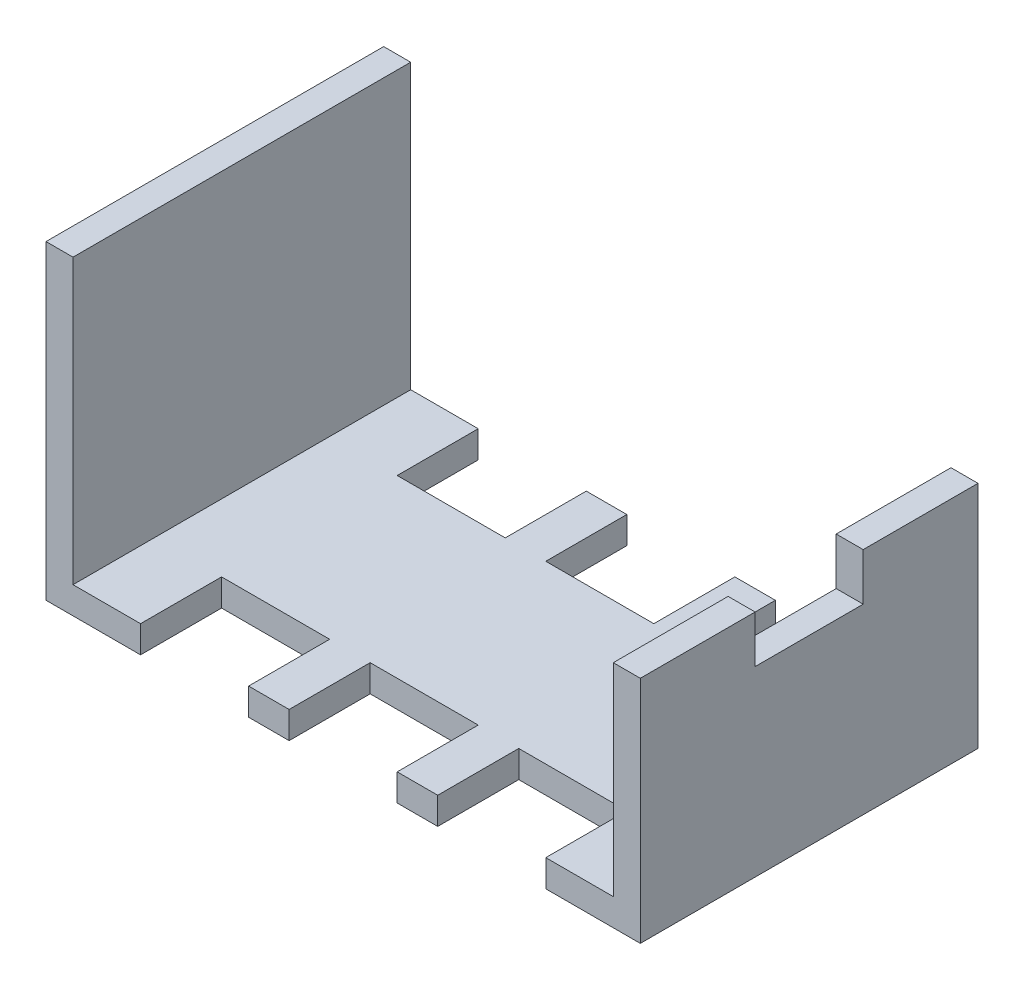
ISO-10303-21;
HEADER;
FILE_DESCRIPTION(('STEP AP214'),'2;1');
FILE_NAME('part.step','',(''),(''),'','','');
FILE_SCHEMA(('AUTOMOTIVE_DESIGN { 1 0 10303 214 1 1 1 1 }'));
ENDSEC;
DATA;
#1=APPLICATION_CONTEXT('core data for automotive mechanical design processes');
#2=APPLICATION_PROTOCOL_DEFINITION('international standard','automotive_design',2000,#1);
#3=PRODUCT_CONTEXT('',#1,'mechanical');
#4=PRODUCT('Part','Part','',(#3));
#5=PRODUCT_RELATED_PRODUCT_CATEGORY('part','',(#4));
#6=PRODUCT_DEFINITION_FORMATION('','',#4);
#7=PRODUCT_DEFINITION_CONTEXT('part definition',#1,'design');
#8=PRODUCT_DEFINITION('design','',#6,#7);
#9=PRODUCT_DEFINITION_SHAPE('','',#8);
#10=(LENGTH_UNIT() NAMED_UNIT(*) SI_UNIT(.MILLI.,.METRE.));
#11=(NAMED_UNIT(*) PLANE_ANGLE_UNIT() SI_UNIT($,.RADIAN.));
#12=(NAMED_UNIT(*) SI_UNIT($,.STERADIAN.) SOLID_ANGLE_UNIT());
#13=UNCERTAINTY_MEASURE_WITH_UNIT(LENGTH_MEASURE(1.E-05),#10,'distance_accuracy_value','');
#14=(GEOMETRIC_REPRESENTATION_CONTEXT(3) GLOBAL_UNCERTAINTY_ASSIGNED_CONTEXT((#13)) GLOBAL_UNIT_ASSIGNED_CONTEXT((#10,
#11,#12)) REPRESENTATION_CONTEXT('',''));
#15=CARTESIAN_POINT('',(0.,0.,0.));
#16=DIRECTION('',(0.,0.,1.));
#17=DIRECTION('',(1.,0.,0.));
#18=AXIS2_PLACEMENT_3D('',#15,#16,#17);
#19=CARTESIAN_POINT('',(0.,0.,0.));
#20=DIRECTION('',(0.,1.,0.));
#21=DIRECTION('',(0.,0.,1.));
#22=AXIS2_PLACEMENT_3D('',#19,#20,#21);
#23=PLANE('',#22);
#24=DIRECTION('',(0.,0.,-1.));
#25=VECTOR('',#24,1.);
#26=CARTESIAN_POINT('',(22.,0.,-14.5));
#27=LINE('',#26,#25);
#28=CARTESIAN_POINT('',(22.,0.,12.5));
#29=VERTEX_POINT('',#28);
#30=CARTESIAN_POINT('',(22.,0.,-12.5));
#31=VERTEX_POINT('',#30);
#32=EDGE_CURVE('E285',#29,#31,#27,.T.);
#33=ORIENTED_EDGE('',*,*,#32,.F.);
#34=DIRECTION('',(-1.,0.,0.));
#35=VECTOR('',#34,1.);
#36=CARTESIAN_POINT('',(-22.,0.,12.5));
#37=LINE('',#36,#35);
#38=CARTESIAN_POINT('',(15.,0.,12.5));
#39=VERTEX_POINT('',#38);
#40=EDGE_CURVE('E267',#29,#39,#37,.T.);
#41=ORIENTED_EDGE('',*,*,#40,.T.);
#42=DIRECTION('',(0.,0.,-1.));
#43=VECTOR('',#42,1.);
#44=CARTESIAN_POINT('',(15.,0.,12.5));
#45=LINE('',#44,#43);
#46=CARTESIAN_POINT('',(15.,0.,6.5));
#47=VERTEX_POINT('',#46);
#48=EDGE_CURVE('E470',#39,#47,#45,.T.);
#49=ORIENTED_EDGE('',*,*,#48,.T.);
#50=DIRECTION('',(1.,0.,0.));
#51=VECTOR('',#50,1.);
#52=CARTESIAN_POINT('',(7.00000000000001,0.,6.5));
#53=LINE('',#52,#51);
#54=CARTESIAN_POINT('',(7.00000000000001,0.,6.5));
#55=VERTEX_POINT('',#54);
#56=EDGE_CURVE('E467',#55,#47,#53,.T.);
#57=ORIENTED_EDGE('',*,*,#56,.F.);
#58=DIRECTION('',(0.,0.,-1.));
#59=VECTOR('',#58,1.);
#60=CARTESIAN_POINT('',(7.00000000000001,0.,12.5));
#61=LINE('',#60,#59);
#62=CARTESIAN_POINT('',(7.00000000000001,0.,12.5));
#63=VERTEX_POINT('',#62);
#64=EDGE_CURVE('E472',#63,#55,#61,.T.);
#65=ORIENTED_EDGE('',*,*,#64,.F.);
#66=CARTESIAN_POINT('',(4.00000000000001,0.,12.5));
#67=VERTEX_POINT('',#66);
#68=EDGE_CURVE('E278',#63,#67,#37,.T.);
#69=ORIENTED_EDGE('',*,*,#68,.T.);
#70=DIRECTION('',(0.,0.,-1.));
#71=VECTOR('',#70,1.);
#72=CARTESIAN_POINT('',(4.00000000000001,0.,12.5));
#73=LINE('',#72,#71);
#74=CARTESIAN_POINT('',(4.00000000000001,0.,6.5));
#75=VERTEX_POINT('',#74);
#76=EDGE_CURVE('E490',#67,#75,#73,.T.);
#77=ORIENTED_EDGE('',*,*,#76,.T.);
#78=DIRECTION('',(1.,0.,0.));
#79=VECTOR('',#78,1.);
#80=CARTESIAN_POINT('',(-3.99999999999999,0.,6.5));
#81=LINE('',#80,#79);
#82=CARTESIAN_POINT('',(-3.99999999999999,0.,6.5));
#83=VERTEX_POINT('',#82);
#84=EDGE_CURVE('E494',#83,#75,#81,.T.);
#85=ORIENTED_EDGE('',*,*,#84,.F.);
#86=DIRECTION('',(0.,0.,-1.));
#87=VECTOR('',#86,1.);
#88=CARTESIAN_POINT('',(-3.99999999999999,0.,12.5));
#89=LINE('',#88,#87);
#90=CARTESIAN_POINT('',(-3.99999999999999,0.,12.5));
#91=VERTEX_POINT('',#90);
#92=EDGE_CURVE('E497',#91,#83,#89,.T.);
#93=ORIENTED_EDGE('',*,*,#92,.F.);
#94=CARTESIAN_POINT('',(-6.99999999999999,0.,12.5));
#95=VERTEX_POINT('',#94);
#96=EDGE_CURVE('E533',#91,#95,#37,.T.);
#97=ORIENTED_EDGE('',*,*,#96,.T.);
#98=DIRECTION('',(0.,0.,-1.));
#99=VECTOR('',#98,1.);
#100=CARTESIAN_POINT('',(-6.99999999999999,0.,12.5));
#101=LINE('',#100,#99);
#102=CARTESIAN_POINT('',(-6.99999999999999,0.,6.5));
#103=VERTEX_POINT('',#102);
#104=EDGE_CURVE('E373',#95,#103,#101,.T.);
#105=ORIENTED_EDGE('',*,*,#104,.T.);
#106=DIRECTION('',(1.,0.,0.));
#107=VECTOR('',#106,1.);
#108=CARTESIAN_POINT('',(-15.,0.,6.5));
#109=LINE('',#108,#107);
#110=CARTESIAN_POINT('',(-15.,0.,6.5));
#111=VERTEX_POINT('',#110);
#112=EDGE_CURVE('E387',#111,#103,#109,.T.);
#113=ORIENTED_EDGE('',*,*,#112,.F.);
#114=DIRECTION('',(0.,0.,-1.));
#115=VECTOR('',#114,1.);
#116=CARTESIAN_POINT('',(-15.,0.,12.5));
#117=LINE('',#116,#115);
#118=CARTESIAN_POINT('',(-15.,0.,12.5));
#119=VERTEX_POINT('',#118);
#120=EDGE_CURVE('E377',#119,#111,#117,.T.);
#121=ORIENTED_EDGE('',*,*,#120,.F.);
#122=CARTESIAN_POINT('',(-22.,0.,12.5));
#123=VERTEX_POINT('',#122);
#124=EDGE_CURVE('E280',#119,#123,#37,.T.);
#125=ORIENTED_EDGE('',*,*,#124,.T.);
#126=DIRECTION('',(0.,0.,1.));
#127=VECTOR('',#126,1.);
#128=CARTESIAN_POINT('',(-22.,0.,-14.5));
#129=LINE('',#128,#127);
#130=CARTESIAN_POINT('',(-22.,0.,-12.5));
#131=VERTEX_POINT('',#130);
#132=EDGE_CURVE('E36',#131,#123,#129,.T.);
#133=ORIENTED_EDGE('',*,*,#132,.F.);
#134=DIRECTION('',(1.,0.,0.));
#135=VECTOR('',#134,1.);
#136=CARTESIAN_POINT('',(-22.,0.,-12.5));
#137=LINE('',#136,#135);
#138=CARTESIAN_POINT('',(-15.,0.,-12.5));
#139=VERTEX_POINT('',#138);
#140=EDGE_CURVE('E520',#131,#139,#137,.T.);
#141=ORIENTED_EDGE('',*,*,#140,.T.);
#142=DIRECTION('',(0.,0.,1.));
#143=VECTOR('',#142,1.);
#144=CARTESIAN_POINT('',(-15.,0.,-12.5));
#145=LINE('',#144,#143);
#146=CARTESIAN_POINT('',(-15.,0.,-6.5));
#147=VERTEX_POINT('',#146);
#148=EDGE_CURVE('E390',#139,#147,#145,.T.);
#149=ORIENTED_EDGE('',*,*,#148,.T.);
#150=DIRECTION('',(1.,0.,0.));
#151=VECTOR('',#150,1.);
#152=CARTESIAN_POINT('',(-15.,0.,-6.5));
#153=LINE('',#152,#151);
#154=CARTESIAN_POINT('',(-6.99999999999999,0.,-6.5));
#155=VERTEX_POINT('',#154);
#156=EDGE_CURVE('E394',#147,#155,#153,.T.);
#157=ORIENTED_EDGE('',*,*,#156,.T.);
#158=DIRECTION('',(0.,0.,1.));
#159=VECTOR('',#158,1.);
#160=CARTESIAN_POINT('',(-6.99999999999999,0.,-12.5));
#161=LINE('',#160,#159);
#162=CARTESIAN_POINT('',(-6.99999999999999,0.,-12.5));
#163=VERTEX_POINT('',#162);
#164=EDGE_CURVE('E397',#163,#155,#161,.T.);
#165=ORIENTED_EDGE('',*,*,#164,.F.);
#166=CARTESIAN_POINT('',(-3.99999999999999,0.,-12.5));
#167=VERTEX_POINT('',#166);
#168=EDGE_CURVE('E526',#163,#167,#137,.T.);
#169=ORIENTED_EDGE('',*,*,#168,.T.);
#170=DIRECTION('',(0.,0.,1.));
#171=VECTOR('',#170,1.);
#172=CARTESIAN_POINT('',(-3.99999999999999,0.,-12.5));
#173=LINE('',#172,#171);
#174=CARTESIAN_POINT('',(-3.99999999999999,0.,-6.5));
#175=VERTEX_POINT('',#174);
#176=EDGE_CURVE('E416',#167,#175,#173,.T.);
#177=ORIENTED_EDGE('',*,*,#176,.T.);
#178=DIRECTION('',(1.,0.,0.));
#179=VECTOR('',#178,1.);
#180=CARTESIAN_POINT('',(-3.99999999999999,0.,-6.5));
#181=LINE('',#180,#179);
#182=CARTESIAN_POINT('',(4.00000000000001,0.,-6.5));
#183=VERTEX_POINT('',#182);
#184=EDGE_CURVE('E420',#175,#183,#181,.T.);
#185=ORIENTED_EDGE('',*,*,#184,.T.);
#186=DIRECTION('',(0.,0.,1.));
#187=VECTOR('',#186,1.);
#188=CARTESIAN_POINT('',(4.00000000000001,0.,-12.5));
#189=LINE('',#188,#187);
#190=CARTESIAN_POINT('',(4.00000000000001,0.,-12.5));
#191=VERTEX_POINT('',#190);
#192=EDGE_CURVE('E423',#191,#183,#189,.T.);
#193=ORIENTED_EDGE('',*,*,#192,.F.);
#194=CARTESIAN_POINT('',(7.00000000000001,0.,-12.5));
#195=VERTEX_POINT('',#194);
#196=EDGE_CURVE('E604',#191,#195,#137,.T.);
#197=ORIENTED_EDGE('',*,*,#196,.T.);
#198=DIRECTION('',(0.,0.,1.));
#199=VECTOR('',#198,1.);
#200=CARTESIAN_POINT('',(7.00000000000001,0.,-12.5));
#201=LINE('',#200,#199);
#202=CARTESIAN_POINT('',(7.00000000000001,0.,-6.5));
#203=VERTEX_POINT('',#202);
#204=EDGE_CURVE('E440',#195,#203,#201,.T.);
#205=ORIENTED_EDGE('',*,*,#204,.T.);
#206=DIRECTION('',(1.,0.,0.));
#207=VECTOR('',#206,1.);
#208=CARTESIAN_POINT('',(7.00000000000001,0.,-6.5));
#209=LINE('',#208,#207);
#210=CARTESIAN_POINT('',(15.,0.,-6.5));
#211=VERTEX_POINT('',#210);
#212=EDGE_CURVE('E444',#203,#211,#209,.T.);
#213=ORIENTED_EDGE('',*,*,#212,.T.);
#214=DIRECTION('',(0.,0.,1.));
#215=VECTOR('',#214,1.);
#216=CARTESIAN_POINT('',(15.,0.,-12.5));
#217=LINE('',#216,#215);
#218=CARTESIAN_POINT('',(15.,0.,-12.5));
#219=VERTEX_POINT('',#218);
#220=EDGE_CURVE('E447',#219,#211,#217,.T.);
#221=ORIENTED_EDGE('',*,*,#220,.F.);
#222=EDGE_CURVE('E293',#219,#31,#137,.T.);
#223=ORIENTED_EDGE('',*,*,#222,.T.);
#224=EDGE_LOOP('',(#33,#41,#49,#57,#65,#69,#77,#85,#93,#97,#105,#113,#121,#125,#133,#141,#149,
#157,#165,#169,#177,#185,#193,#197,#205,#213,#221,#223));
#225=FACE_BOUND('',#224,.T.);
#226=ADVANCED_FACE('F32',(#225),#23,.F.);
#227=CARTESIAN_POINT('',(0.,2.,0.));
#228=DIRECTION('',(0.,-1.,0.));
#229=DIRECTION('',(0.,0.,-1.));
#230=AXIS2_PLACEMENT_3D('',#227,#228,#229);
#231=PLANE('',#230);
#232=DIRECTION('',(0.,0.,-1.));
#233=VECTOR('',#232,1.);
#234=CARTESIAN_POINT('',(-6.99999999999999,2.,12.5));
#235=LINE('',#234,#233);
#236=CARTESIAN_POINT('',(-6.99999999999999,2.,12.5));
#237=VERTEX_POINT('',#236);
#238=CARTESIAN_POINT('',(-6.99999999999999,2.,6.5));
#239=VERTEX_POINT('',#238);
#240=EDGE_CURVE('E374',#237,#239,#235,.T.);
#241=ORIENTED_EDGE('',*,*,#240,.F.);
#242=DIRECTION('',(1.,0.,0.));
#243=VECTOR('',#242,1.);
#244=CARTESIAN_POINT('',(0.,2.,12.5));
#245=LINE('',#244,#243);
#246=CARTESIAN_POINT('',(-3.99999999999999,2.,12.5));
#247=VERTEX_POINT('',#246);
#248=EDGE_CURVE('E411',#237,#247,#245,.T.);
#249=ORIENTED_EDGE('',*,*,#248,.T.);
#250=DIRECTION('',(0.,0.,-1.));
#251=VECTOR('',#250,1.);
#252=CARTESIAN_POINT('',(-3.99999999999999,2.,12.5));
#253=LINE('',#252,#251);
#254=CARTESIAN_POINT('',(-3.99999999999999,2.,6.5));
#255=VERTEX_POINT('',#254);
#256=EDGE_CURVE('E493',#247,#255,#253,.T.);
#257=ORIENTED_EDGE('',*,*,#256,.T.);
#258=DIRECTION('',(1.,0.,0.));
#259=VECTOR('',#258,1.);
#260=CARTESIAN_POINT('',(-3.99999999999999,2.,6.5));
#261=LINE('',#260,#259);
#262=CARTESIAN_POINT('',(4.00000000000001,2.,6.5));
#263=VERTEX_POINT('',#262);
#264=EDGE_CURVE('E502',#255,#263,#261,.T.);
#265=ORIENTED_EDGE('',*,*,#264,.T.);
#266=DIRECTION('',(0.,0.,-1.));
#267=VECTOR('',#266,1.);
#268=CARTESIAN_POINT('',(4.00000000000001,2.,12.5));
#269=LINE('',#268,#267);
#270=CARTESIAN_POINT('',(4.00000000000001,2.,12.5));
#271=VERTEX_POINT('',#270);
#272=EDGE_CURVE('E384',#271,#263,#269,.T.);
#273=ORIENTED_EDGE('',*,*,#272,.F.);
#274=CARTESIAN_POINT('',(7.00000000000001,2.,12.5));
#275=VERTEX_POINT('',#274);
#276=EDGE_CURVE('E516',#271,#275,#245,.T.);
#277=ORIENTED_EDGE('',*,*,#276,.T.);
#278=DIRECTION('',(0.,0.,-1.));
#279=VECTOR('',#278,1.);
#280=CARTESIAN_POINT('',(7.00000000000001,2.,12.5));
#281=LINE('',#280,#279);
#282=CARTESIAN_POINT('',(7.00000000000001,2.,6.5));
#283=VERTEX_POINT('',#282);
#284=EDGE_CURVE('E469',#275,#283,#281,.T.);
#285=ORIENTED_EDGE('',*,*,#284,.T.);
#286=DIRECTION('',(1.,0.,0.));
#287=VECTOR('',#286,1.);
#288=CARTESIAN_POINT('',(7.00000000000001,2.,6.5));
#289=LINE('',#288,#287);
#290=CARTESIAN_POINT('',(15.,2.,6.5));
#291=VERTEX_POINT('',#290);
#292=EDGE_CURVE('E475',#283,#291,#289,.T.);
#293=ORIENTED_EDGE('',*,*,#292,.T.);
#294=DIRECTION('',(0.,0.,-1.));
#295=VECTOR('',#294,1.);
#296=CARTESIAN_POINT('',(15.,2.,12.5));
#297=LINE('',#296,#295);
#298=CARTESIAN_POINT('',(15.,2.,12.5));
#299=VERTEX_POINT('',#298);
#300=EDGE_CURVE('E479',#299,#291,#297,.T.);
#301=ORIENTED_EDGE('',*,*,#300,.F.);
#302=DIRECTION('',(1.,0.,0.));
#303=VECTOR('',#302,1.);
#304=CARTESIAN_POINT('',(-20.,2.,12.5));
#305=LINE('',#304,#303);
#306=CARTESIAN_POINT('',(20.,2.,12.5));
#307=VERTEX_POINT('',#306);
#308=EDGE_CURVE('E310',#299,#307,#305,.T.);
#309=ORIENTED_EDGE('',*,*,#308,.T.);
#310=DIRECTION('',(0.,0.,1.));
#311=VECTOR('',#310,1.);
#312=CARTESIAN_POINT('',(20.,2.,-12.5));
#313=LINE('',#312,#311);
#314=CARTESIAN_POINT('',(20.,2.,-12.5));
#315=VERTEX_POINT('',#314);
#316=EDGE_CURVE('E318',#315,#307,#313,.T.);
#317=ORIENTED_EDGE('',*,*,#316,.F.);
#318=DIRECTION('',(1.,0.,0.));
#319=VECTOR('',#318,1.);
#320=CARTESIAN_POINT('',(-20.,2.,-12.5));
#321=LINE('',#320,#319);
#322=CARTESIAN_POINT('',(15.,2.,-12.5));
#323=VERTEX_POINT('',#322);
#324=EDGE_CURVE('E317',#323,#315,#321,.T.);
#325=ORIENTED_EDGE('',*,*,#324,.F.);
#326=DIRECTION('',(0.,0.,1.));
#327=VECTOR('',#326,1.);
#328=CARTESIAN_POINT('',(15.,2.,-12.5));
#329=LINE('',#328,#327);
#330=CARTESIAN_POINT('',(15.,2.,-6.5));
#331=VERTEX_POINT('',#330);
#332=EDGE_CURVE('E443',#323,#331,#329,.T.);
#333=ORIENTED_EDGE('',*,*,#332,.T.);
#334=DIRECTION('',(1.,0.,0.));
#335=VECTOR('',#334,1.);
#336=CARTESIAN_POINT('',(7.00000000000001,2.,-6.5));
#337=LINE('',#336,#335);
#338=CARTESIAN_POINT('',(7.00000000000001,2.,-6.5));
#339=VERTEX_POINT('',#338);
#340=EDGE_CURVE('E454',#339,#331,#337,.T.);
#341=ORIENTED_EDGE('',*,*,#340,.F.);
#342=DIRECTION('',(0.,0.,1.));
#343=VECTOR('',#342,1.);
#344=CARTESIAN_POINT('',(7.00000000000001,2.,-12.5));
#345=LINE('',#344,#343);
#346=CARTESIAN_POINT('',(7.00000000000001,2.,-12.5));
#347=VERTEX_POINT('',#346);
#348=EDGE_CURVE('E451',#347,#339,#345,.T.);
#349=ORIENTED_EDGE('',*,*,#348,.F.);
#350=CARTESIAN_POINT('',(4.00000000000001,2.,-12.5));
#351=VERTEX_POINT('',#350);
#352=EDGE_CURVE('E977',#351,#347,#321,.T.);
#353=ORIENTED_EDGE('',*,*,#352,.F.);
#354=DIRECTION('',(0.,0.,1.));
#355=VECTOR('',#354,1.);
#356=CARTESIAN_POINT('',(4.00000000000001,2.,-12.5));
#357=LINE('',#356,#355);
#358=CARTESIAN_POINT('',(4.00000000000001,2.,-6.5));
#359=VERTEX_POINT('',#358);
#360=EDGE_CURVE('E419',#351,#359,#357,.T.);
#361=ORIENTED_EDGE('',*,*,#360,.T.);
#362=DIRECTION('',(1.,0.,0.));
#363=VECTOR('',#362,1.);
#364=CARTESIAN_POINT('',(-3.99999999999999,2.,-6.5));
#365=LINE('',#364,#363);
#366=CARTESIAN_POINT('',(-3.99999999999999,2.,-6.5));
#367=VERTEX_POINT('',#366);
#368=EDGE_CURVE('E429',#367,#359,#365,.T.);
#369=ORIENTED_EDGE('',*,*,#368,.F.);
#370=DIRECTION('',(0.,0.,1.));
#371=VECTOR('',#370,1.);
#372=CARTESIAN_POINT('',(-3.99999999999999,2.,-12.5));
#373=LINE('',#372,#371);
#374=CARTESIAN_POINT('',(-3.99999999999999,2.,-12.5));
#375=VERTEX_POINT('',#374);
#376=EDGE_CURVE('E426',#375,#367,#373,.T.);
#377=ORIENTED_EDGE('',*,*,#376,.F.);
#378=CARTESIAN_POINT('',(-6.99999999999999,2.,-12.5));
#379=VERTEX_POINT('',#378);
#380=EDGE_CURVE('E316',#379,#375,#321,.T.);
#381=ORIENTED_EDGE('',*,*,#380,.F.);
#382=DIRECTION('',(0.,0.,1.));
#383=VECTOR('',#382,1.);
#384=CARTESIAN_POINT('',(-6.99999999999999,2.,-12.5));
#385=LINE('',#384,#383);
#386=CARTESIAN_POINT('',(-6.99999999999999,2.,-6.5));
#387=VERTEX_POINT('',#386);
#388=EDGE_CURVE('E393',#379,#387,#385,.T.);
#389=ORIENTED_EDGE('',*,*,#388,.T.);
#390=DIRECTION('',(1.,0.,0.));
#391=VECTOR('',#390,1.);
#392=CARTESIAN_POINT('',(-15.,2.,-6.5));
#393=LINE('',#392,#391);
#394=CARTESIAN_POINT('',(-15.,2.,-6.5));
#395=VERTEX_POINT('',#394);
#396=EDGE_CURVE('E403',#395,#387,#393,.T.);
#397=ORIENTED_EDGE('',*,*,#396,.F.);
#398=DIRECTION('',(0.,0.,1.));
#399=VECTOR('',#398,1.);
#400=CARTESIAN_POINT('',(-15.,2.,-12.5));
#401=LINE('',#400,#399);
#402=CARTESIAN_POINT('',(-15.,2.,-12.5));
#403=VERTEX_POINT('',#402);
#404=EDGE_CURVE('E400',#403,#395,#401,.T.);
#405=ORIENTED_EDGE('',*,*,#404,.F.);
#406=CARTESIAN_POINT('',(-20.,2.,-12.5));
#407=VERTEX_POINT('',#406);
#408=EDGE_CURVE('E314',#407,#403,#321,.T.);
#409=ORIENTED_EDGE('',*,*,#408,.F.);
#410=DIRECTION('',(0.,0.,1.));
#411=VECTOR('',#410,1.);
#412=CARTESIAN_POINT('',(-20.,2.,-12.5));
#413=LINE('',#412,#411);
#414=CARTESIAN_POINT('',(-20.,2.,12.5));
#415=VERTEX_POINT('',#414);
#416=EDGE_CURVE('E303',#407,#415,#413,.T.);
#417=ORIENTED_EDGE('',*,*,#416,.T.);
#418=CARTESIAN_POINT('',(-15.,2.,12.5));
#419=VERTEX_POINT('',#418);
#420=EDGE_CURVE('E321',#415,#419,#305,.T.);
#421=ORIENTED_EDGE('',*,*,#420,.T.);
#422=DIRECTION('',(0.,0.,-1.));
#423=VECTOR('',#422,1.);
#424=CARTESIAN_POINT('',(-15.,2.,12.5));
#425=LINE('',#424,#423);
#426=CARTESIAN_POINT('',(-15.,2.,6.5));
#427=VERTEX_POINT('',#426);
#428=EDGE_CURVE('E381',#419,#427,#425,.T.);
#429=ORIENTED_EDGE('',*,*,#428,.T.);
#430=DIRECTION('',(1.,0.,0.));
#431=VECTOR('',#430,1.);
#432=CARTESIAN_POINT('',(-15.,2.,6.5));
#433=LINE('',#432,#431);
#434=EDGE_CURVE('E378',#427,#239,#433,.T.);
#435=ORIENTED_EDGE('',*,*,#434,.T.);
#436=EDGE_LOOP('',(#241,#249,#257,#265,#273,#277,#285,#293,#301,#309,#317,#325,#333,#341,#349,
#353,#361,#369,#377,#381,#389,#397,#405,#409,#417,#421,#429,#435));
#437=FACE_BOUND('',#436,.T.);
#438=ADVANCED_FACE('F561',(#437),#231,.F.);
#439=CARTESIAN_POINT('',(22.,23.,-14.5));
#440=DIRECTION('',(-1.,0.,0.));
#441=DIRECTION('',(0.,0.,1.));
#442=AXIS2_PLACEMENT_3D('',#439,#440,#441);
#443=PLANE('',#442);
#444=DIRECTION('',(0.,0.,-1.));
#445=VECTOR('',#444,1.);
#446=CARTESIAN_POINT('',(22.,17.,12.5));
#447=LINE('',#446,#445);
#448=CARTESIAN_POINT('',(22.,17.,12.5));
#449=VERTEX_POINT('',#448);
#450=CARTESIAN_POINT('',(22.,17.,4.));
#451=VERTEX_POINT('',#450);
#452=EDGE_CURVE('E288',#449,#451,#447,.T.);
#453=ORIENTED_EDGE('',*,*,#452,.F.);
#454=DIRECTION('',(0.,1.,0.));
#455=VECTOR('',#454,1.);
#456=CARTESIAN_POINT('',(22.,0.,12.5));
#457=LINE('',#456,#455);
#458=EDGE_CURVE('E270',#29,#449,#457,.T.);
#459=ORIENTED_EDGE('',*,*,#458,.F.);
#460=ORIENTED_EDGE('',*,*,#32,.T.);
#461=DIRECTION('',(0.,1.,0.));
#462=VECTOR('',#461,1.);
#463=CARTESIAN_POINT('',(22.,0.,-12.5));
#464=LINE('',#463,#462);
#465=CARTESIAN_POINT('',(22.,17.,-12.5));
#466=VERTEX_POINT('',#465);
#467=EDGE_CURVE('E519',#31,#466,#464,.T.);
#468=ORIENTED_EDGE('',*,*,#467,.T.);
#469=DIRECTION('',(0.,0.,-1.));
#470=VECTOR('',#469,1.);
#471=CARTESIAN_POINT('',(22.,17.,-4.));
#472=LINE('',#471,#470);
#473=CARTESIAN_POINT('',(22.,17.,-4.));
#474=VERTEX_POINT('',#473);
#475=EDGE_CURVE('E336',#474,#466,#472,.T.);
#476=ORIENTED_EDGE('',*,*,#475,.F.);
#477=DIRECTION('',(0.,1.,0.));
#478=VECTOR('',#477,1.);
#479=CARTESIAN_POINT('',(22.,13.5,-4.));
#480=LINE('',#479,#478);
#481=CARTESIAN_POINT('',(22.,13.5,-4.));
#482=VERTEX_POINT('',#481);
#483=EDGE_CURVE('E340',#482,#474,#480,.T.);
#484=ORIENTED_EDGE('',*,*,#483,.F.);
#485=DIRECTION('',(0.,0.,-1.));
#486=VECTOR('',#485,1.);
#487=CARTESIAN_POINT('',(22.,13.5,4.));
#488=LINE('',#487,#486);
#489=CARTESIAN_POINT('',(22.,13.5,4.));
#490=VERTEX_POINT('',#489);
#491=EDGE_CURVE('E343',#490,#482,#488,.T.);
#492=ORIENTED_EDGE('',*,*,#491,.F.);
#493=DIRECTION('',(0.,-1.,0.));
#494=VECTOR('',#493,1.);
#495=CARTESIAN_POINT('',(22.,13.5,4.));
#496=LINE('',#495,#494);
#497=EDGE_CURVE('E346',#451,#490,#496,.T.);
#498=ORIENTED_EDGE('',*,*,#497,.F.);
#499=EDGE_LOOP('',(#453,#459,#460,#468,#476,#484,#492,#498));
#500=FACE_BOUND('',#499,.T.);
#501=ADVANCED_FACE('F34',(#500),#443,.F.);
#502=CARTESIAN_POINT('',(-22.,23.,-14.5));
#503=DIRECTION('',(1.,0.,0.));
#504=DIRECTION('',(0.,0.,-1.));
#505=AXIS2_PLACEMENT_3D('',#502,#503,#504);
#506=PLANE('',#505);
#507=ORIENTED_EDGE('',*,*,#132,.T.);
#508=DIRECTION('',(0.,1.,0.));
#509=VECTOR('',#508,1.);
#510=CARTESIAN_POINT('',(-22.,0.,12.5));
#511=LINE('',#510,#509);
#512=CARTESIAN_POINT('',(-22.,23.,12.5));
#513=VERTEX_POINT('',#512);
#514=EDGE_CURVE('E289',#123,#513,#511,.T.);
#515=ORIENTED_EDGE('',*,*,#514,.T.);
#516=DIRECTION('',(0.,0.,1.));
#517=VECTOR('',#516,1.);
#518=CARTESIAN_POINT('',(-22.,23.,-14.5));
#519=LINE('',#518,#517);
#520=CARTESIAN_POINT('',(-22.,23.,-12.5));
#521=VERTEX_POINT('',#520);
#522=EDGE_CURVE('E11',#521,#513,#519,.T.);
#523=ORIENTED_EDGE('',*,*,#522,.F.);
#524=DIRECTION('',(0.,1.,0.));
#525=VECTOR('',#524,1.);
#526=CARTESIAN_POINT('',(-22.,0.,-12.5));
#527=LINE('',#526,#525);
#528=EDGE_CURVE('E517',#131,#521,#527,.T.);
#529=ORIENTED_EDGE('',*,*,#528,.F.);
#530=EDGE_LOOP('',(#507,#515,#523,#529));
#531=FACE_BOUND('',#530,.T.);
#532=ADVANCED_FACE('F586',(#531),#506,.F.);
#533=CARTESIAN_POINT('',(0.,23.,0.));
#534=DIRECTION('',(0.,1.,0.));
#535=DIRECTION('',(0.,0.,1.));
#536=AXIS2_PLACEMENT_3D('',#533,#534,#535);
#537=PLANE('',#536);
#538=DIRECTION('',(-1.,0.,0.));
#539=VECTOR('',#538,1.);
#540=CARTESIAN_POINT('',(-22.,23.,12.5));
#541=LINE('',#540,#539);
#542=CARTESIAN_POINT('',(-20.,23.,12.5));
#543=VERTEX_POINT('',#542);
#544=EDGE_CURVE('E522',#543,#513,#541,.T.);
#545=ORIENTED_EDGE('',*,*,#544,.F.);
#546=DIRECTION('',(0.,0.,1.));
#547=VECTOR('',#546,1.);
#548=CARTESIAN_POINT('',(-20.,23.,-12.5));
#549=LINE('',#548,#547);
#550=CARTESIAN_POINT('',(-20.,23.,-12.5));
#551=VERTEX_POINT('',#550);
#552=EDGE_CURVE('E307',#551,#543,#549,.T.);
#553=ORIENTED_EDGE('',*,*,#552,.F.);
#554=DIRECTION('',(1.,0.,0.));
#555=VECTOR('',#554,1.);
#556=CARTESIAN_POINT('',(-22.,23.,-12.5));
#557=LINE('',#556,#555);
#558=EDGE_CURVE('E523',#521,#551,#557,.T.);
#559=ORIENTED_EDGE('',*,*,#558,.F.);
#560=ORIENTED_EDGE('',*,*,#522,.T.);
#561=EDGE_LOOP('',(#545,#553,#559,#560));
#562=FACE_BOUND('',#561,.T.);
#563=ADVANCED_FACE('F582',(#562),#537,.T.);
#564=CARTESIAN_POINT('',(-20.,2.,-12.5));
#565=DIRECTION('',(-1.,0.,0.));
#566=DIRECTION('',(0.,0.,1.));
#567=AXIS2_PLACEMENT_3D('',#564,#565,#566);
#568=PLANE('',#567);
#569=ORIENTED_EDGE('',*,*,#552,.T.);
#570=DIRECTION('',(0.,1.,0.));
#571=VECTOR('',#570,1.);
#572=CARTESIAN_POINT('',(-20.,2.,12.5));
#573=LINE('',#572,#571);
#574=EDGE_CURVE('E294',#415,#543,#573,.T.);
#575=ORIENTED_EDGE('',*,*,#574,.F.);
#576=ORIENTED_EDGE('',*,*,#416,.F.);
#577=DIRECTION('',(0.,1.,0.));
#578=VECTOR('',#577,1.);
#579=CARTESIAN_POINT('',(-20.,2.,-12.5));
#580=LINE('',#579,#578);
#581=EDGE_CURVE('E296',#407,#551,#580,.T.);
#582=ORIENTED_EDGE('',*,*,#581,.T.);
#583=EDGE_LOOP('',(#569,#575,#576,#582));
#584=FACE_BOUND('',#583,.T.);
#585=ADVANCED_FACE('F578',(#584),#568,.F.);
#586=CARTESIAN_POINT('',(20.,2.,-12.5));
#587=DIRECTION('',(-1.,0.,0.));
#588=DIRECTION('',(0.,0.,1.));
#589=AXIS2_PLACEMENT_3D('',#586,#587,#588);
#590=PLANE('',#589);
#591=DIRECTION('',(0.,1.,0.));
#592=VECTOR('',#591,1.);
#593=CARTESIAN_POINT('',(20.,2.,-12.5));
#594=LINE('',#593,#592);
#595=CARTESIAN_POINT('',(20.,17.,-12.5));
#596=VERTEX_POINT('',#595);
#597=EDGE_CURVE('E302',#315,#596,#594,.T.);
#598=ORIENTED_EDGE('',*,*,#597,.F.);
#599=ORIENTED_EDGE('',*,*,#316,.T.);
#600=DIRECTION('',(0.,1.,0.));
#601=VECTOR('',#600,1.);
#602=CARTESIAN_POINT('',(20.,2.,12.5));
#603=LINE('',#602,#601);
#604=CARTESIAN_POINT('',(20.,17.,12.5));
#605=VERTEX_POINT('',#604);
#606=EDGE_CURVE('E299',#307,#605,#603,.T.);
#607=ORIENTED_EDGE('',*,*,#606,.T.);
#608=DIRECTION('',(0.,0.,-1.));
#609=VECTOR('',#608,1.);
#610=CARTESIAN_POINT('',(20.,17.,12.5));
#611=LINE('',#610,#609);
#612=CARTESIAN_POINT('',(20.,17.,4.));
#613=VERTEX_POINT('',#612);
#614=EDGE_CURVE('E339',#605,#613,#611,.T.);
#615=ORIENTED_EDGE('',*,*,#614,.T.);
#616=DIRECTION('',(0.,-1.,0.));
#617=VECTOR('',#616,1.);
#618=CARTESIAN_POINT('',(20.,13.5,4.));
#619=LINE('',#618,#617);
#620=CARTESIAN_POINT('',(20.,13.5,4.));
#621=VERTEX_POINT('',#620);
#622=EDGE_CURVE('E359',#613,#621,#619,.T.);
#623=ORIENTED_EDGE('',*,*,#622,.T.);
#624=DIRECTION('',(0.,0.,-1.));
#625=VECTOR('',#624,1.);
#626=CARTESIAN_POINT('',(20.,13.5,4.));
#627=LINE('',#626,#625);
#628=CARTESIAN_POINT('',(20.,13.5,-4.));
#629=VERTEX_POINT('',#628);
#630=EDGE_CURVE('E356',#621,#629,#627,.T.);
#631=ORIENTED_EDGE('',*,*,#630,.T.);
#632=DIRECTION('',(0.,1.,0.));
#633=VECTOR('',#632,1.);
#634=CARTESIAN_POINT('',(20.,13.5,-4.));
#635=LINE('',#634,#633);
#636=CARTESIAN_POINT('',(20.,17.,-4.));
#637=VERTEX_POINT('',#636);
#638=EDGE_CURVE('E353',#629,#637,#635,.T.);
#639=ORIENTED_EDGE('',*,*,#638,.T.);
#640=DIRECTION('',(0.,0.,-1.));
#641=VECTOR('',#640,1.);
#642=CARTESIAN_POINT('',(20.,17.,-4.));
#643=LINE('',#642,#641);
#644=EDGE_CURVE('E327',#637,#596,#643,.T.);
#645=ORIENTED_EDGE('',*,*,#644,.T.);
#646=EDGE_LOOP('',(#598,#599,#607,#615,#623,#631,#639,#645));
#647=FACE_BOUND('',#646,.T.);
#648=ADVANCED_FACE('F647',(#647),#590,.T.);
#649=CARTESIAN_POINT('',(20.,17.,-4.));
#650=DIRECTION('',(0.,-1.,0.));
#651=DIRECTION('',(0.,0.,-1.));
#652=AXIS2_PLACEMENT_3D('',#649,#650,#651);
#653=PLANE('',#652);
#654=ORIENTED_EDGE('',*,*,#475,.T.);
#655=DIRECTION('',(1.,0.,0.));
#656=VECTOR('',#655,1.);
#657=CARTESIAN_POINT('',(20.,17.,-12.5));
#658=LINE('',#657,#656);
#659=EDGE_CURVE('E311',#596,#466,#658,.T.);
#660=ORIENTED_EDGE('',*,*,#659,.F.);
#661=ORIENTED_EDGE('',*,*,#644,.F.);
#662=DIRECTION('',(1.,0.,0.));
#663=VECTOR('',#662,1.);
#664=CARTESIAN_POINT('',(20.,17.,-4.));
#665=LINE('',#664,#663);
#666=EDGE_CURVE('E333',#637,#474,#665,.T.);
#667=ORIENTED_EDGE('',*,*,#666,.T.);
#668=EDGE_LOOP('',(#654,#660,#661,#667));
#669=FACE_BOUND('',#668,.T.);
#670=ADVANCED_FACE('F629',(#669),#653,.F.);
#671=CARTESIAN_POINT('',(20.,13.5,-4.));
#672=DIRECTION('',(0.,0.,-1.));
#673=DIRECTION('',(-1.,0.,0.));
#674=AXIS2_PLACEMENT_3D('',#671,#672,#673);
#675=PLANE('',#674);
#676=ORIENTED_EDGE('',*,*,#483,.T.);
#677=ORIENTED_EDGE('',*,*,#666,.F.);
#678=ORIENTED_EDGE('',*,*,#638,.F.);
#679=DIRECTION('',(1.,0.,0.));
#680=VECTOR('',#679,1.);
#681=CARTESIAN_POINT('',(20.,13.5,-4.));
#682=LINE('',#681,#680);
#683=EDGE_CURVE('E331',#629,#482,#682,.T.);
#684=ORIENTED_EDGE('',*,*,#683,.T.);
#685=EDGE_LOOP('',(#676,#677,#678,#684));
#686=FACE_BOUND('',#685,.T.);
#687=ADVANCED_FACE('F633',(#686),#675,.F.);
#688=CARTESIAN_POINT('',(20.,13.5,4.));
#689=DIRECTION('',(0.,-1.,0.));
#690=DIRECTION('',(0.,0.,-1.));
#691=AXIS2_PLACEMENT_3D('',#688,#689,#690);
#692=PLANE('',#691);
#693=ORIENTED_EDGE('',*,*,#491,.T.);
#694=ORIENTED_EDGE('',*,*,#683,.F.);
#695=ORIENTED_EDGE('',*,*,#630,.F.);
#696=DIRECTION('',(1.,0.,0.));
#697=VECTOR('',#696,1.);
#698=CARTESIAN_POINT('',(20.,13.5,4.));
#699=LINE('',#698,#697);
#700=EDGE_CURVE('E329',#621,#490,#699,.T.);
#701=ORIENTED_EDGE('',*,*,#700,.T.);
#702=EDGE_LOOP('',(#693,#694,#695,#701));
#703=FACE_BOUND('',#702,.T.);
#704=ADVANCED_FACE('F636',(#703),#692,.F.);
#705=CARTESIAN_POINT('',(20.,13.5,4.));
#706=DIRECTION('',(0.,0.,1.));
#707=DIRECTION('',(1.,0.,0.));
#708=AXIS2_PLACEMENT_3D('',#705,#706,#707);
#709=PLANE('',#708);
#710=ORIENTED_EDGE('',*,*,#497,.T.);
#711=ORIENTED_EDGE('',*,*,#700,.F.);
#712=ORIENTED_EDGE('',*,*,#622,.F.);
#713=DIRECTION('',(1.,0.,0.));
#714=VECTOR('',#713,1.);
#715=CARTESIAN_POINT('',(20.,17.,4.));
#716=LINE('',#715,#714);
#717=EDGE_CURVE('E326',#613,#451,#716,.T.);
#718=ORIENTED_EDGE('',*,*,#717,.T.);
#719=EDGE_LOOP('',(#710,#711,#712,#718));
#720=FACE_BOUND('',#719,.T.);
#721=ADVANCED_FACE('F639',(#720),#709,.F.);
#722=CARTESIAN_POINT('',(20.,17.,12.5));
#723=DIRECTION('',(0.,-1.,0.));
#724=DIRECTION('',(0.,0.,-1.));
#725=AXIS2_PLACEMENT_3D('',#722,#723,#724);
#726=PLANE('',#725);
#727=ORIENTED_EDGE('',*,*,#452,.T.);
#728=ORIENTED_EDGE('',*,*,#717,.F.);
#729=ORIENTED_EDGE('',*,*,#614,.F.);
#730=DIRECTION('',(1.,0.,0.));
#731=VECTOR('',#730,1.);
#732=CARTESIAN_POINT('',(20.,17.,12.5));
#733=LINE('',#732,#731);
#734=EDGE_CURVE('E324',#605,#449,#733,.T.);
#735=ORIENTED_EDGE('',*,*,#734,.T.);
#736=EDGE_LOOP('',(#727,#728,#729,#735));
#737=FACE_BOUND('',#736,.T.);
#738=ADVANCED_FACE('F643',(#737),#726,.F.);
#739=CARTESIAN_POINT('',(-15.,0.,12.5));
#740=DIRECTION('',(1.,0.,0.));
#741=DIRECTION('',(0.,0.,-1.));
#742=AXIS2_PLACEMENT_3D('',#739,#740,#741);
#743=PLANE('',#742);
#744=ORIENTED_EDGE('',*,*,#428,.F.);
#745=DIRECTION('',(0.,1.,0.));
#746=VECTOR('',#745,1.);
#747=CARTESIAN_POINT('',(-15.,0.,12.5));
#748=LINE('',#747,#746);
#749=EDGE_CURVE('E371',#119,#419,#748,.T.);
#750=ORIENTED_EDGE('',*,*,#749,.F.);
#751=ORIENTED_EDGE('',*,*,#120,.T.);
#752=DIRECTION('',(0.,1.,0.));
#753=VECTOR('',#752,1.);
#754=CARTESIAN_POINT('',(-15.,0.,6.5));
#755=LINE('',#754,#753);
#756=EDGE_CURVE('E350',#111,#427,#755,.T.);
#757=ORIENTED_EDGE('',*,*,#756,.T.);
#758=EDGE_LOOP('',(#744,#750,#751,#757));
#759=FACE_BOUND('',#758,.T.);
#760=ADVANCED_FACE('F571',(#759),#743,.T.);
#761=CARTESIAN_POINT('',(-15.,0.,6.5));
#762=DIRECTION('',(0.,0.,1.));
#763=DIRECTION('',(1.,0.,0.));
#764=AXIS2_PLACEMENT_3D('',#761,#762,#763);
#765=PLANE('',#764);
#766=ORIENTED_EDGE('',*,*,#434,.F.);
#767=ORIENTED_EDGE('',*,*,#756,.F.);
#768=ORIENTED_EDGE('',*,*,#112,.T.);
#769=DIRECTION('',(0.,1.,0.));
#770=VECTOR('',#769,1.);
#771=CARTESIAN_POINT('',(-6.99999999999999,0.,6.5));
#772=LINE('',#771,#770);
#773=EDGE_CURVE('E366',#103,#239,#772,.T.);
#774=ORIENTED_EDGE('',*,*,#773,.T.);
#775=EDGE_LOOP('',(#766,#767,#768,#774));
#776=FACE_BOUND('',#775,.T.);
#777=ADVANCED_FACE('F568',(#776),#765,.T.);
#778=CARTESIAN_POINT('',(-6.99999999999999,0.,12.5));
#779=DIRECTION('',(1.,0.,0.));
#780=DIRECTION('',(0.,0.,-1.));
#781=AXIS2_PLACEMENT_3D('',#778,#779,#780);
#782=PLANE('',#781);
#783=ORIENTED_EDGE('',*,*,#240,.T.);
#784=ORIENTED_EDGE('',*,*,#773,.F.);
#785=ORIENTED_EDGE('',*,*,#104,.F.);
#786=DIRECTION('',(0.,1.,0.));
#787=VECTOR('',#786,1.);
#788=CARTESIAN_POINT('',(-6.99999999999999,0.,12.5));
#789=LINE('',#788,#787);
#790=EDGE_CURVE('E368',#95,#237,#789,.T.);
#791=ORIENTED_EDGE('',*,*,#790,.T.);
#792=EDGE_LOOP('',(#783,#784,#785,#791));
#793=FACE_BOUND('',#792,.T.);
#794=ADVANCED_FACE('F564',(#793),#782,.F.);
#795=CARTESIAN_POINT('',(-3.99999999999999,0.,12.5));
#796=DIRECTION('',(1.,0.,0.));
#797=DIRECTION('',(0.,0.,-1.));
#798=AXIS2_PLACEMENT_3D('',#795,#796,#797);
#799=PLANE('',#798);
#800=ORIENTED_EDGE('',*,*,#256,.F.);
#801=DIRECTION('',(0.,1.,0.));
#802=VECTOR('',#801,1.);
#803=CARTESIAN_POINT('',(-3.99999999999999,0.,12.5));
#804=LINE('',#803,#802);
#805=EDGE_CURVE('E478',#91,#247,#804,.T.);
#806=ORIENTED_EDGE('',*,*,#805,.F.);
#807=ORIENTED_EDGE('',*,*,#92,.T.);
#808=DIRECTION('',(0.,1.,0.));
#809=VECTOR('',#808,1.);
#810=CARTESIAN_POINT('',(-3.99999999999999,0.,6.5));
#811=LINE('',#810,#809);
#812=EDGE_CURVE('E508',#83,#255,#811,.T.);
#813=ORIENTED_EDGE('',*,*,#812,.T.);
#814=EDGE_LOOP('',(#800,#806,#807,#813));
#815=FACE_BOUND('',#814,.T.);
#816=ADVANCED_FACE('F556',(#815),#799,.T.);
#817=CARTESIAN_POINT('',(-3.99999999999999,0.,6.5));
#818=DIRECTION('',(0.,0.,1.));
#819=DIRECTION('',(1.,0.,0.));
#820=AXIS2_PLACEMENT_3D('',#817,#818,#819);
#821=PLANE('',#820);
#822=ORIENTED_EDGE('',*,*,#264,.F.);
#823=ORIENTED_EDGE('',*,*,#812,.F.);
#824=ORIENTED_EDGE('',*,*,#84,.T.);
#825=DIRECTION('',(0.,1.,0.));
#826=VECTOR('',#825,1.);
#827=CARTESIAN_POINT('',(4.00000000000001,0.,6.5));
#828=LINE('',#827,#826);
#829=EDGE_CURVE('E510',#75,#263,#828,.T.);
#830=ORIENTED_EDGE('',*,*,#829,.T.);
#831=EDGE_LOOP('',(#822,#823,#824,#830));
#832=FACE_BOUND('',#831,.T.);
#833=ADVANCED_FACE('F552',(#832),#821,.T.);
#834=CARTESIAN_POINT('',(4.00000000000001,0.,12.5));
#835=DIRECTION('',(1.,0.,0.));
#836=DIRECTION('',(0.,0.,-1.));
#837=AXIS2_PLACEMENT_3D('',#834,#835,#836);
#838=PLANE('',#837);
#839=ORIENTED_EDGE('',*,*,#272,.T.);
#840=ORIENTED_EDGE('',*,*,#829,.F.);
#841=ORIENTED_EDGE('',*,*,#76,.F.);
#842=DIRECTION('',(0.,1.,0.));
#843=VECTOR('',#842,1.);
#844=CARTESIAN_POINT('',(4.00000000000001,0.,12.5));
#845=LINE('',#844,#843);
#846=EDGE_CURVE('E499',#67,#271,#845,.T.);
#847=ORIENTED_EDGE('',*,*,#846,.T.);
#848=EDGE_LOOP('',(#839,#840,#841,#847));
#849=FACE_BOUND('',#848,.T.);
#850=ADVANCED_FACE('F547',(#849),#838,.F.);
#851=CARTESIAN_POINT('',(7.00000000000001,0.,6.5));
#852=DIRECTION('',(0.,0.,1.));
#853=DIRECTION('',(1.,0.,0.));
#854=AXIS2_PLACEMENT_3D('',#851,#852,#853);
#855=PLANE('',#854);
#856=ORIENTED_EDGE('',*,*,#292,.F.);
#857=DIRECTION('',(0.,1.,0.));
#858=VECTOR('',#857,1.);
#859=CARTESIAN_POINT('',(7.00000000000001,0.,6.5));
#860=LINE('',#859,#858);
#861=EDGE_CURVE('E474',#55,#283,#860,.T.);
#862=ORIENTED_EDGE('',*,*,#861,.F.);
#863=ORIENTED_EDGE('',*,*,#56,.T.);
#864=DIRECTION('',(0.,1.,0.));
#865=VECTOR('',#864,1.);
#866=CARTESIAN_POINT('',(15.,0.,6.5));
#867=LINE('',#866,#865);
#868=EDGE_CURVE('E453',#47,#291,#867,.T.);
#869=ORIENTED_EDGE('',*,*,#868,.T.);
#870=EDGE_LOOP('',(#856,#862,#863,#869));
#871=FACE_BOUND('',#870,.T.);
#872=ADVANCED_FACE('F654',(#871),#855,.T.);
#873=CARTESIAN_POINT('',(15.,0.,12.5));
#874=DIRECTION('',(1.,0.,0.));
#875=DIRECTION('',(0.,0.,-1.));
#876=AXIS2_PLACEMENT_3D('',#873,#874,#875);
#877=PLANE('',#876);
#878=ORIENTED_EDGE('',*,*,#300,.T.);
#879=ORIENTED_EDGE('',*,*,#868,.F.);
#880=ORIENTED_EDGE('',*,*,#48,.F.);
#881=DIRECTION('',(0.,1.,0.));
#882=VECTOR('',#881,1.);
#883=CARTESIAN_POINT('',(15.,0.,12.5));
#884=LINE('',#883,#882);
#885=EDGE_CURVE('E273',#39,#299,#884,.T.);
#886=ORIENTED_EDGE('',*,*,#885,.T.);
#887=EDGE_LOOP('',(#878,#879,#880,#886));
#888=FACE_BOUND('',#887,.T.);
#889=ADVANCED_FACE('F651',(#888),#877,.F.);
#890=CARTESIAN_POINT('',(7.00000000000001,0.,12.5));
#891=DIRECTION('',(1.,0.,0.));
#892=DIRECTION('',(0.,0.,-1.));
#893=AXIS2_PLACEMENT_3D('',#890,#891,#892);
#894=PLANE('',#893);
#895=ORIENTED_EDGE('',*,*,#284,.F.);
#896=DIRECTION('',(0.,1.,0.));
#897=VECTOR('',#896,1.);
#898=CARTESIAN_POINT('',(7.00000000000001,0.,12.5));
#899=LINE('',#898,#897);
#900=EDGE_CURVE('E486',#63,#275,#899,.T.);
#901=ORIENTED_EDGE('',*,*,#900,.F.);
#902=ORIENTED_EDGE('',*,*,#64,.T.);
#903=ORIENTED_EDGE('',*,*,#861,.T.);
#904=EDGE_LOOP('',(#895,#901,#902,#903));
#905=FACE_BOUND('',#904,.T.);
#906=ADVANCED_FACE('F657',(#905),#894,.T.);
#907=CARTESIAN_POINT('',(7.00000000000001,0.,-12.5));
#908=DIRECTION('',(-1.,0.,0.));
#909=DIRECTION('',(0.,0.,1.));
#910=AXIS2_PLACEMENT_3D('',#907,#908,#909);
#911=PLANE('',#910);
#912=ORIENTED_EDGE('',*,*,#348,.T.);
#913=DIRECTION('',(0.,1.,0.));
#914=VECTOR('',#913,1.);
#915=CARTESIAN_POINT('',(7.00000000000001,0.,-6.5));
#916=LINE('',#915,#914);
#917=EDGE_CURVE('E450',#203,#339,#916,.T.);
#918=ORIENTED_EDGE('',*,*,#917,.F.);
#919=ORIENTED_EDGE('',*,*,#204,.F.);
#920=DIRECTION('',(0.,1.,0.));
#921=VECTOR('',#920,1.);
#922=CARTESIAN_POINT('',(7.00000000000001,0.,-12.5));
#923=LINE('',#922,#921);
#924=EDGE_CURVE('E428',#195,#347,#923,.T.);
#925=ORIENTED_EDGE('',*,*,#924,.T.);
#926=EDGE_LOOP('',(#912,#918,#919,#925));
#927=FACE_BOUND('',#926,.T.);
#928=ADVANCED_FACE('F611',(#927),#911,.F.);
#929=CARTESIAN_POINT('',(15.,0.,-12.5));
#930=DIRECTION('',(-1.,0.,0.));
#931=DIRECTION('',(0.,0.,1.));
#932=AXIS2_PLACEMENT_3D('',#929,#930,#931);
#933=PLANE('',#932);
#934=ORIENTED_EDGE('',*,*,#332,.F.);
#935=DIRECTION('',(0.,1.,0.));
#936=VECTOR('',#935,1.);
#937=CARTESIAN_POINT('',(15.,0.,-12.5));
#938=LINE('',#937,#936);
#939=EDGE_CURVE('E461',#219,#323,#938,.T.);
#940=ORIENTED_EDGE('',*,*,#939,.F.);
#941=ORIENTED_EDGE('',*,*,#220,.T.);
#942=DIRECTION('',(0.,1.,0.));
#943=VECTOR('',#942,1.);
#944=CARTESIAN_POINT('',(15.,0.,-6.5));
#945=LINE('',#944,#943);
#946=EDGE_CURVE('E463',#211,#331,#945,.T.);
#947=ORIENTED_EDGE('',*,*,#946,.T.);
#948=EDGE_LOOP('',(#934,#940,#941,#947));
#949=FACE_BOUND('',#948,.T.);
#950=ADVANCED_FACE('F620',(#949),#933,.T.);
#951=CARTESIAN_POINT('',(7.00000000000001,0.,-6.5));
#952=DIRECTION('',(0.,0.,1.));
#953=DIRECTION('',(1.,0.,0.));
#954=AXIS2_PLACEMENT_3D('',#951,#952,#953);
#955=PLANE('',#954);
#956=ORIENTED_EDGE('',*,*,#340,.T.);
#957=ORIENTED_EDGE('',*,*,#946,.F.);
#958=ORIENTED_EDGE('',*,*,#212,.F.);
#959=ORIENTED_EDGE('',*,*,#917,.T.);
#960=EDGE_LOOP('',(#956,#957,#958,#959));
#961=FACE_BOUND('',#960,.T.);
#962=ADVANCED_FACE('F616',(#961),#955,.F.);
#963=CARTESIAN_POINT('',(-3.99999999999999,0.,-12.5));
#964=DIRECTION('',(-1.,0.,0.));
#965=DIRECTION('',(0.,0.,1.));
#966=AXIS2_PLACEMENT_3D('',#963,#964,#965);
#967=PLANE('',#966);
#968=ORIENTED_EDGE('',*,*,#376,.T.);
#969=DIRECTION('',(0.,1.,0.));
#970=VECTOR('',#969,1.);
#971=CARTESIAN_POINT('',(-3.99999999999999,0.,-6.5));
#972=LINE('',#971,#970);
#973=EDGE_CURVE('E425',#175,#367,#972,.T.);
#974=ORIENTED_EDGE('',*,*,#973,.F.);
#975=ORIENTED_EDGE('',*,*,#176,.F.);
#976=DIRECTION('',(0.,1.,0.));
#977=VECTOR('',#976,1.);
#978=CARTESIAN_POINT('',(-3.99999999999999,0.,-12.5));
#979=LINE('',#978,#977);
#980=EDGE_CURVE('E402',#167,#375,#979,.T.);
#981=ORIENTED_EDGE('',*,*,#980,.T.);
#982=EDGE_LOOP('',(#968,#974,#975,#981));
#983=FACE_BOUND('',#982,.T.);
#984=ADVANCED_FACE('F731',(#983),#967,.F.);
#985=CARTESIAN_POINT('',(4.00000000000001,0.,-12.5));
#986=DIRECTION('',(-1.,0.,0.));
#987=DIRECTION('',(0.,0.,1.));
#988=AXIS2_PLACEMENT_3D('',#985,#986,#987);
#989=PLANE('',#988);
#990=ORIENTED_EDGE('',*,*,#360,.F.);
#991=DIRECTION('',(0.,1.,0.));
#992=VECTOR('',#991,1.);
#993=CARTESIAN_POINT('',(4.00000000000001,0.,-12.5));
#994=LINE('',#993,#992);
#995=EDGE_CURVE('E435',#191,#351,#994,.T.);
#996=ORIENTED_EDGE('',*,*,#995,.F.);
#997=ORIENTED_EDGE('',*,*,#192,.T.);
#998=DIRECTION('',(0.,1.,0.));
#999=VECTOR('',#998,1.);
#1000=CARTESIAN_POINT('',(4.00000000000001,0.,-6.5));
#1001=LINE('',#1000,#999);
#1002=EDGE_CURVE('E56',#183,#359,#1001,.T.);
#1003=ORIENTED_EDGE('',*,*,#1002,.T.);
#1004=EDGE_LOOP('',(#990,#996,#997,#1003));
#1005=FACE_BOUND('',#1004,.T.);
#1006=ADVANCED_FACE('F718',(#1005),#989,.T.);
#1007=CARTESIAN_POINT('',(-3.99999999999999,0.,-6.5));
#1008=DIRECTION('',(0.,0.,1.));
#1009=DIRECTION('',(1.,0.,0.));
#1010=AXIS2_PLACEMENT_3D('',#1007,#1008,#1009);
#1011=PLANE('',#1010);
#1012=ORIENTED_EDGE('',*,*,#368,.T.);
#1013=ORIENTED_EDGE('',*,*,#1002,.F.);
#1014=ORIENTED_EDGE('',*,*,#184,.F.);
#1015=ORIENTED_EDGE('',*,*,#973,.T.);
#1016=EDGE_LOOP('',(#1012,#1013,#1014,#1015));
#1017=FACE_BOUND('',#1016,.T.);
#1018=ADVANCED_FACE('F713',(#1017),#1011,.F.);
#1019=CARTESIAN_POINT('',(-15.,0.,-12.5));
#1020=DIRECTION('',(-1.,0.,0.));
#1021=DIRECTION('',(0.,0.,1.));
#1022=AXIS2_PLACEMENT_3D('',#1019,#1020,#1021);
#1023=PLANE('',#1022);
#1024=ORIENTED_EDGE('',*,*,#404,.T.);
#1025=DIRECTION('',(0.,1.,0.));
#1026=VECTOR('',#1025,1.);
#1027=CARTESIAN_POINT('',(-15.,0.,-6.5));
#1028=LINE('',#1027,#1026);
#1029=EDGE_CURVE('E399',#147,#395,#1028,.T.);
#1030=ORIENTED_EDGE('',*,*,#1029,.F.);
#1031=ORIENTED_EDGE('',*,*,#148,.F.);
#1032=DIRECTION('',(0.,1.,0.));
#1033=VECTOR('',#1032,1.);
#1034=CARTESIAN_POINT('',(-15.,0.,-12.5));
#1035=LINE('',#1034,#1033);
#1036=EDGE_CURVE('E407',#139,#403,#1035,.T.);
#1037=ORIENTED_EDGE('',*,*,#1036,.T.);
#1038=EDGE_LOOP('',(#1024,#1030,#1031,#1037));
#1039=FACE_BOUND('',#1038,.T.);
#1040=ADVANCED_FACE('F590',(#1039),#1023,.F.);
#1041=CARTESIAN_POINT('',(-6.99999999999999,0.,-12.5));
#1042=DIRECTION('',(-1.,0.,0.));
#1043=DIRECTION('',(0.,0.,1.));
#1044=AXIS2_PLACEMENT_3D('',#1041,#1042,#1043);
#1045=PLANE('',#1044);
#1046=ORIENTED_EDGE('',*,*,#388,.F.);
#1047=DIRECTION('',(0.,1.,0.));
#1048=VECTOR('',#1047,1.);
#1049=CARTESIAN_POINT('',(-6.99999999999999,0.,-12.5));
#1050=LINE('',#1049,#1048);
#1051=EDGE_CURVE('E410',#163,#379,#1050,.T.);
#1052=ORIENTED_EDGE('',*,*,#1051,.F.);
#1053=ORIENTED_EDGE('',*,*,#164,.T.);
#1054=DIRECTION('',(0.,1.,0.));
#1055=VECTOR('',#1054,1.);
#1056=CARTESIAN_POINT('',(-6.99999999999999,0.,-6.5));
#1057=LINE('',#1056,#1055);
#1058=EDGE_CURVE('E48',#155,#387,#1057,.T.);
#1059=ORIENTED_EDGE('',*,*,#1058,.T.);
#1060=EDGE_LOOP('',(#1046,#1052,#1053,#1059));
#1061=FACE_BOUND('',#1060,.T.);
#1062=ADVANCED_FACE('F600',(#1061),#1045,.T.);
#1063=CARTESIAN_POINT('',(-15.,0.,-6.5));
#1064=DIRECTION('',(0.,0.,1.));
#1065=DIRECTION('',(1.,0.,0.));
#1066=AXIS2_PLACEMENT_3D('',#1063,#1064,#1065);
#1067=PLANE('',#1066);
#1068=ORIENTED_EDGE('',*,*,#396,.T.);
#1069=ORIENTED_EDGE('',*,*,#1058,.F.);
#1070=ORIENTED_EDGE('',*,*,#156,.F.);
#1071=ORIENTED_EDGE('',*,*,#1029,.T.);
#1072=EDGE_LOOP('',(#1068,#1069,#1070,#1071));
#1073=FACE_BOUND('',#1072,.T.);
#1074=ADVANCED_FACE('F593',(#1073),#1067,.F.);
#1075=CARTESIAN_POINT('',(-22.,0.,-12.5));
#1076=DIRECTION('',(0.,0.,1.));
#1077=DIRECTION('',(1.,0.,0.));
#1078=AXIS2_PLACEMENT_3D('',#1075,#1076,#1077);
#1079=PLANE('',#1078);
#1080=ORIENTED_EDGE('',*,*,#168,.F.);
#1081=ORIENTED_EDGE('',*,*,#1051,.T.);
#1082=ORIENTED_EDGE('',*,*,#380,.T.);
#1083=ORIENTED_EDGE('',*,*,#980,.F.);
#1084=EDGE_LOOP('',(#1080,#1081,#1082,#1083));
#1085=FACE_BOUND('',#1084,.T.);
#1086=ADVANCED_FACE('F603',(#1085),#1079,.F.);
#1087=ORIENTED_EDGE('',*,*,#408,.T.);
#1088=ORIENTED_EDGE('',*,*,#1036,.F.);
#1089=ORIENTED_EDGE('',*,*,#140,.F.);
#1090=ORIENTED_EDGE('',*,*,#528,.T.);
#1091=ORIENTED_EDGE('',*,*,#558,.T.);
#1092=ORIENTED_EDGE('',*,*,#581,.F.);
#1093=EDGE_LOOP('',(#1087,#1088,#1089,#1090,#1091,#1092));
#1094=FACE_BOUND('',#1093,.T.);
#1095=ADVANCED_FACE('F668',(#1094),#1079,.F.);
#1096=ORIENTED_EDGE('',*,*,#196,.F.);
#1097=ORIENTED_EDGE('',*,*,#995,.T.);
#1098=ORIENTED_EDGE('',*,*,#352,.T.);
#1099=ORIENTED_EDGE('',*,*,#924,.F.);
#1100=EDGE_LOOP('',(#1096,#1097,#1098,#1099));
#1101=FACE_BOUND('',#1100,.T.);
#1102=ADVANCED_FACE('F666',(#1101),#1079,.F.);
#1103=ORIENTED_EDGE('',*,*,#597,.T.);
#1104=ORIENTED_EDGE('',*,*,#659,.T.);
#1105=ORIENTED_EDGE('',*,*,#467,.F.);
#1106=ORIENTED_EDGE('',*,*,#222,.F.);
#1107=ORIENTED_EDGE('',*,*,#939,.T.);
#1108=ORIENTED_EDGE('',*,*,#324,.T.);
#1109=EDGE_LOOP('',(#1103,#1104,#1105,#1106,#1107,#1108));
#1110=FACE_BOUND('',#1109,.T.);
#1111=ADVANCED_FACE('F623',(#1110),#1079,.F.);
#1112=CARTESIAN_POINT('',(-22.,0.,12.5));
#1113=DIRECTION('',(0.,0.,-1.));
#1114=DIRECTION('',(-1.,0.,0.));
#1115=AXIS2_PLACEMENT_3D('',#1112,#1113,#1114);
#1116=PLANE('',#1115);
#1117=ORIENTED_EDGE('',*,*,#846,.F.);
#1118=ORIENTED_EDGE('',*,*,#68,.F.);
#1119=ORIENTED_EDGE('',*,*,#900,.T.);
#1120=ORIENTED_EDGE('',*,*,#276,.F.);
#1121=EDGE_LOOP('',(#1117,#1118,#1119,#1120));
#1122=FACE_BOUND('',#1121,.T.);
#1123=ADVANCED_FACE('F659',(#1122),#1116,.F.);
#1124=ORIENTED_EDGE('',*,*,#606,.F.);
#1125=ORIENTED_EDGE('',*,*,#308,.F.);
#1126=ORIENTED_EDGE('',*,*,#885,.F.);
#1127=ORIENTED_EDGE('',*,*,#40,.F.);
#1128=ORIENTED_EDGE('',*,*,#458,.T.);
#1129=ORIENTED_EDGE('',*,*,#734,.F.);
#1130=EDGE_LOOP('',(#1124,#1125,#1126,#1127,#1128,#1129));
#1131=FACE_BOUND('',#1130,.T.);
#1132=ADVANCED_FACE('F269',(#1131),#1116,.F.);
#1133=ORIENTED_EDGE('',*,*,#790,.F.);
#1134=ORIENTED_EDGE('',*,*,#96,.F.);
#1135=ORIENTED_EDGE('',*,*,#805,.T.);
#1136=ORIENTED_EDGE('',*,*,#248,.F.);
#1137=EDGE_LOOP('',(#1133,#1134,#1135,#1136));
#1138=FACE_BOUND('',#1137,.T.);
#1139=ADVANCED_FACE('F558',(#1138),#1116,.F.);
#1140=ORIENTED_EDGE('',*,*,#574,.T.);
#1141=ORIENTED_EDGE('',*,*,#544,.T.);
#1142=ORIENTED_EDGE('',*,*,#514,.F.);
#1143=ORIENTED_EDGE('',*,*,#124,.F.);
#1144=ORIENTED_EDGE('',*,*,#749,.T.);
#1145=ORIENTED_EDGE('',*,*,#420,.F.);
#1146=EDGE_LOOP('',(#1140,#1141,#1142,#1143,#1144,#1145));
#1147=FACE_BOUND('',#1146,.T.);
#1148=ADVANCED_FACE('F576',(#1147),#1116,.F.);
#1149=CLOSED_SHELL('',(#226,#438,#501,#532,#563,#585,#648,#670,#687,#704,#721,#738,#760,#777,
#794,#816,#833,#850,#872,#889,#906,#928,#950,#962,#984,#1006,#1018,#1040,#1062,#1074,#1086,
#1095,#1102,#1111,#1123,#1132,#1139,#1148));
#1150=MANIFOLD_SOLID_BREP('B2',#1149);
#1151=ADVANCED_BREP_SHAPE_REPRESENTATION('',(#18,#1150),#14);
#1152=SHAPE_DEFINITION_REPRESENTATION(#9,#1151);
ENDSEC;
END-ISO-10303-21;
